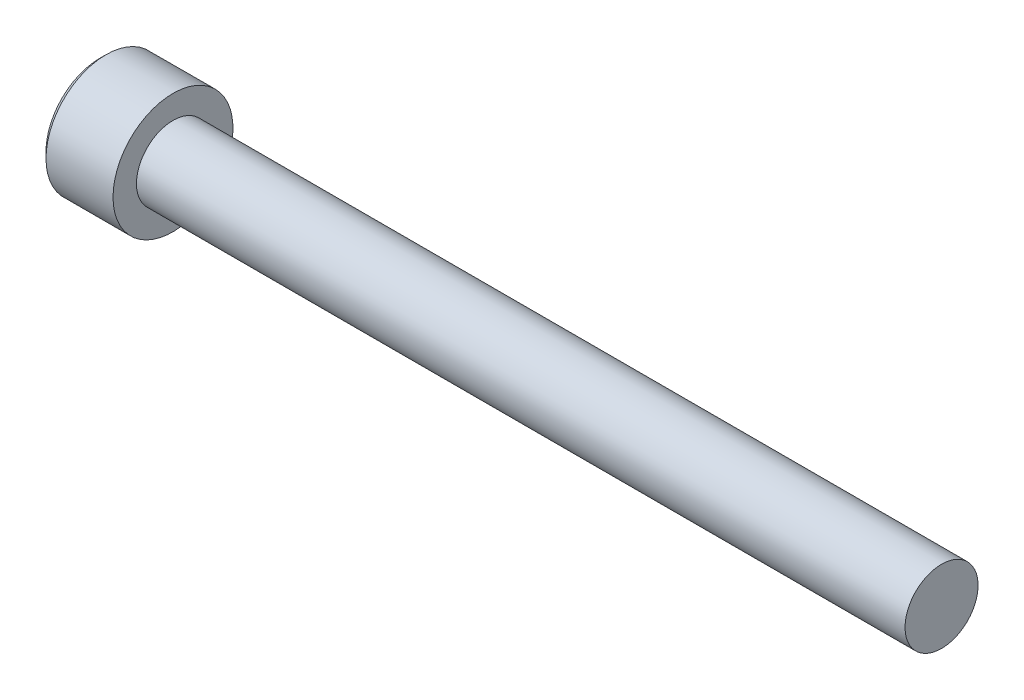
ISO-10303-21;
HEADER;
FILE_DESCRIPTION(('STEP AP214'),'2;1');
FILE_NAME('part.step','',(''),(''),'','','');
FILE_SCHEMA(('AUTOMOTIVE_DESIGN { 1 0 10303 214 1 1 1 1 }'));
ENDSEC;
DATA;
#1=APPLICATION_CONTEXT('core data for automotive mechanical design processes');
#2=APPLICATION_PROTOCOL_DEFINITION('international standard','automotive_design',2000,#1);
#3=PRODUCT_CONTEXT('',#1,'mechanical');
#4=PRODUCT('Part','Part','',(#3));
#5=PRODUCT_RELATED_PRODUCT_CATEGORY('part','',(#4));
#6=PRODUCT_DEFINITION_FORMATION('','',#4);
#7=PRODUCT_DEFINITION_CONTEXT('part definition',#1,'design');
#8=PRODUCT_DEFINITION('design','',#6,#7);
#9=PRODUCT_DEFINITION_SHAPE('','',#8);
#10=(LENGTH_UNIT() NAMED_UNIT(*) SI_UNIT(.MILLI.,.METRE.));
#11=(NAMED_UNIT(*) PLANE_ANGLE_UNIT() SI_UNIT($,.RADIAN.));
#12=(NAMED_UNIT(*) SI_UNIT($,.STERADIAN.) SOLID_ANGLE_UNIT());
#13=UNCERTAINTY_MEASURE_WITH_UNIT(LENGTH_MEASURE(1.E-05),#10,'distance_accuracy_value','');
#14=(GEOMETRIC_REPRESENTATION_CONTEXT(3) GLOBAL_UNCERTAINTY_ASSIGNED_CONTEXT((#13)) GLOBAL_UNIT_ASSIGNED_CONTEXT((#10,
#11,#12)) REPRESENTATION_CONTEXT('',''));
#15=CARTESIAN_POINT('',(0.,0.,0.));
#16=DIRECTION('',(0.,0.,1.));
#17=DIRECTION('',(1.,0.,0.));
#18=AXIS2_PLACEMENT_3D('',#15,#16,#17);
#19=CARTESIAN_POINT('',(-2.28600000000007,-1.14567944042317,1.984375));
#20=DIRECTION('',(0.,0.,1.));
#21=DIRECTION('',(1.,0.,0.));
#22=AXIS2_PLACEMENT_3D('',#19,#20,#21);
#23=PLANE('',#22);
#24=CARTESIAN_POINT('',(-4.82599999995852,1.14567944044653,1.98437499999554));
#25=CARTESIAN_POINT('',(-4.78691618362732,1.06743880343266,1.9843749999984));
#26=CARTESIAN_POINT('',(-4.75011447684892,0.987898318960917,1.98437499999957));
#27=CARTESIAN_POINT('',(-4.68265620500518,0.825677042028778,1.98437500000043));
#28=CARTESIAN_POINT('',(-4.65204056061138,0.742979382529199,1.98437500000012));
#29=CARTESIAN_POINT('',(-4.5991739228306,0.575193959555969,1.98437499999988));
#30=CARTESIAN_POINT('',(-4.57689462080725,0.490115359117279,1.98437499999997));
#31=CARTESIAN_POINT('',(-4.54259467221837,0.318093091130193,1.98437500000003));
#32=CARTESIAN_POINT('',(-4.5305423022885,0.231156054976726,1.984375));
#33=CARTESIAN_POINT('',(-4.52249110263747,0.119918521511051,1.984375));
#34=CARTESIAN_POINT('',(-4.52118947557477,0.0959468443046798,1.984375));
#35=CARTESIAN_POINT('',(-4.51945182629813,0.0479845644411998,1.984375));
#36=CARTESIAN_POINT('',(-4.51901533386223,0.0239939791589393,1.984375));
#37=CARTESIAN_POINT('',(-4.51901809008399,-0.0602201717457363,1.984375));
#38=CARTESIAN_POINT('',(-4.52177452299902,-0.120461721905447,1.984375));
#39=CARTESIAN_POINT('',(-4.5326365512493,-0.240474970989197,1.984375));
#40=CARTESIAN_POINT('',(-4.54074587749718,-0.300246312758427,1.984375));
#41=CARTESIAN_POINT('',(-4.57259622946939,-0.478763752804282,1.984375));
#42=CARTESIAN_POINT('',(-4.60385422611702,-0.596208828937734,1.984375));
#43=CARTESIAN_POINT('',(-4.66780003592237,-0.785921487441256,1.984375));
#44=CARTESIAN_POINT('',(-4.69623457768558,-0.859734609866899,1.984375));
#45=CARTESIAN_POINT('',(-4.75786140400812,-1.00456595519282,1.984375));
#46=CARTESIAN_POINT('',(-4.79100779300359,-1.07560356657101,1.984375));
#47=CARTESIAN_POINT('',(-4.82599999995643,-1.14567944044724,1.984375));
#48=B_SPLINE_CURVE_WITH_KNOTS('',3,(#24,#25,#26,#27,#28,#29,#30,#31,#32,#33,#34,#35,#36,#37,#38,
#39,#40,#41,#42,#43,#44,#45,#46,#47),.UNSPECIFIED.,.F.,.F.,(4,2,2,2,2,2,2,2,2,2,2,4),(0.,
0.262559005207405,0.526801735838036,0.790138824405318,1.05265603861765,1.12466619182083,
1.19663719499031,1.3772702672652,1.55802937209382,1.92104085090328,2.15819130092264,
2.39317265078575),.UNSPECIFIED.);
#49=CARTESIAN_POINT('',(-4.82599999996829,1.14567944041753,1.98437500003084));
#50=VERTEX_POINT('',#49);
#51=CARTESIAN_POINT('',(-4.8259999999622,-1.14567944043207,1.98437500001542));
#52=VERTEX_POINT('',#51);
#53=EDGE_CURVE('E21',#50,#52,#48,.T.);
#54=ORIENTED_EDGE('',*,*,#53,.F.);
#55=DIRECTION('',(1.,0.,0.));
#56=VECTOR('',#55,1.);
#57=CARTESIAN_POINT('',(-2.28600000000007,1.14567944042316,1.984375));
#58=LINE('',#57,#56);
#59=CARTESIAN_POINT('',(-2.28600000000007,1.14567944042316,1.984375));
#60=VERTEX_POINT('',#59);
#61=EDGE_CURVE('E70',#50,#60,#58,.T.);
#62=ORIENTED_EDGE('',*,*,#61,.T.);
#63=DIRECTION('',(0.,1.,0.));
#64=VECTOR('',#63,1.);
#65=CARTESIAN_POINT('',(-2.28600000000007,0.,1.984375));
#66=LINE('',#65,#64);
#67=CARTESIAN_POINT('',(-2.28600000000007,-1.14567944042317,1.984375));
#68=VERTEX_POINT('',#67);
#69=EDGE_CURVE('E76',#68,#60,#66,.T.);
#70=ORIENTED_EDGE('',*,*,#69,.F.);
#71=DIRECTION('',(1.,0.,0.));
#72=VECTOR('',#71,1.);
#73=CARTESIAN_POINT('',(-2.28600000000007,-1.14567944042317,1.984375));
#74=LINE('',#73,#72);
#75=EDGE_CURVE('E73',#68,#52,#74,.F.);
#76=ORIENTED_EDGE('',*,*,#75,.T.);
#77=EDGE_LOOP('',(#54,#62,#70,#76));
#78=FACE_BOUND('',#77,.T.);
#79=ADVANCED_FACE('F17',(#78),#23,.F.);
#80=CARTESIAN_POINT('',(-2.28600000000007,0.,0.));
#81=DIRECTION('',(-1.,0.,0.));
#82=DIRECTION('',(0.,0.,1.));
#83=AXIS2_PLACEMENT_3D('',#80,#81,#82);
#84=PLANE('',#83);
#85=DIRECTION('',(0.,0.5,0.866025403784439));
#86=VECTOR('',#85,1.);
#87=CARTESIAN_POINT('',(-2.28600000000007,2.29135888084633,0.));
#88=LINE('',#87,#86);
#89=CARTESIAN_POINT('',(-2.28600000000007,2.29135888084633,0.));
#90=VERTEX_POINT('',#89);
#91=CARTESIAN_POINT('',(-2.28600000000007,1.14567944042316,-1.984375));
#92=VERTEX_POINT('',#91);
#93=EDGE_CURVE('E84',#90,#92,#88,.F.);
#94=ORIENTED_EDGE('',*,*,#93,.T.);
#95=DIRECTION('',(0.,1.,0.));
#96=VECTOR('',#95,1.);
#97=CARTESIAN_POINT('',(-2.28600000000007,1.14567944042316,-1.984375));
#98=LINE('',#97,#96);
#99=CARTESIAN_POINT('',(-2.28600000000007,-1.14567944042316,-1.984375));
#100=VERTEX_POINT('',#99);
#101=EDGE_CURVE('E249',#92,#100,#98,.F.);
#102=ORIENTED_EDGE('',*,*,#101,.T.);
#103=DIRECTION('',(0.,0.5,-0.866025403784439));
#104=VECTOR('',#103,1.);
#105=CARTESIAN_POINT('',(-2.28600000000007,-1.14567944042316,-1.984375));
#106=LINE('',#105,#104);
#107=CARTESIAN_POINT('',(-2.28600000000007,-2.29135888084633,0.));
#108=VERTEX_POINT('',#107);
#109=EDGE_CURVE('E234',#100,#108,#106,.F.);
#110=ORIENTED_EDGE('',*,*,#109,.T.);
#111=DIRECTION('',(0.,-0.5,-0.866025403784439));
#112=VECTOR('',#111,1.);
#113=CARTESIAN_POINT('',(-2.28600000000007,-2.29135888084633,0.));
#114=LINE('',#113,#112);
#115=EDGE_CURVE('E231',#108,#68,#114,.F.);
#116=ORIENTED_EDGE('',*,*,#115,.T.);
#117=ORIENTED_EDGE('',*,*,#69,.T.);
#118=DIRECTION('',(0.,-0.5,0.866025403784439));
#119=VECTOR('',#118,1.);
#120=CARTESIAN_POINT('',(-2.28600000000007,1.14567944042316,1.984375));
#121=LINE('',#120,#119);
#122=EDGE_CURVE('E83',#60,#90,#121,.F.);
#123=ORIENTED_EDGE('',*,*,#122,.T.);
#124=EDGE_LOOP('',(#94,#102,#110,#116,#117,#123));
#125=FACE_BOUND('',#124,.T.);
#126=ADVANCED_FACE('F166',(#125),#84,.T.);
#127=CARTESIAN_POINT('',(-2.28600000000007,-1.14567944042316,-1.984375));
#128=DIRECTION('',(0.,-0.866025403784439,-0.5));
#129=DIRECTION('',(0.,0.5,-0.866025403784439));
#130=AXIS2_PLACEMENT_3D('',#127,#128,#129);
#131=PLANE('',#130);
#132=CARTESIAN_POINT('',(-4.82599999995871,-1.14567944040756,-1.98437500001887));
#133=CARTESIAN_POINT('',(-4.78666022792997,-1.18505700230148,-1.91617106214563));
#134=CARTESIAN_POINT('',(-4.74963132844072,-1.22509295783734,-1.8468267530301));
#135=CARTESIAN_POINT('',(-4.68183299424977,-1.30673037975396,-1.70542659047317));
#136=CARTESIAN_POINT('',(-4.65110127019237,-1.34833960561553,-1.63335729721673));
#137=CARTESIAN_POINT('',(-4.59845762010516,-1.432242568594,-1.48803310243203));
#138=CARTESIAN_POINT('',(-4.57641341195893,-1.47451494967301,-1.41481519064643));
#139=CARTESIAN_POINT('',(-4.5424501106744,-1.55999007976842,-1.26676792253773));
#140=CARTESIAN_POINT('',(-4.53050567471972,-1.6031902195197,-1.19194308559438));
#141=CARTESIAN_POINT('',(-4.51972842752365,-1.67764765054852,-1.06297903205139));
#142=CARTESIAN_POINT('',(-4.51813352794835,-1.70880881707173,-1.00900630841009));
#143=CARTESIAN_POINT('',(-4.52082392138599,-1.77108016542046,-0.901149169214274));
#144=CARTESIAN_POINT('',(-4.52511127545884,-1.80219032554946,-0.847264791239237));
#145=CARTESIAN_POINT('',(-4.53932219421538,-1.86411684097343,-0.740004920189235));
#146=CARTESIAN_POINT('',(-4.54925206045723,-1.8949328285454,-0.686630064029166));
#147=CARTESIAN_POINT('',(-4.5742029484467,-1.95603190279815,-0.580803363127977));
#148=CARTESIAN_POINT('',(-4.58922357974385,-1.98631503016081,-0.528351447923769));
#149=CARTESIAN_POINT('',(-4.63380478900425,-2.06386502548479,-0.394030915895904));
#150=CARTESIAN_POINT('',(-4.66672213384104,-2.11065153226583,-0.312994309042483));
#151=CARTESIAN_POINT('',(-4.72228952038986,-2.17944749410732,-0.193836207777459));
#152=CARTESIAN_POINT('',(-4.74181309375939,-2.20211890802843,-0.154568166986659));
#153=CARTESIAN_POINT('',(-4.78263970065987,-2.24704195201531,-0.076759172370747));
#154=CARTESIAN_POINT('',(-4.80394164363173,-2.2692938292399,-0.038217790453971));
#155=CARTESIAN_POINT('',(-4.82599999995675,-2.29135888085868,2.13931096249392E-11));
#156=B_SPLINE_CURVE_WITH_KNOTS('',3,(#132,#133,#134,#135,#136,#137,#138,#139,#140,#141,#142,
#143,#144,#145,#146,#147,#148,#149,#150,#151,#152,#153,#154,#155),.UNSPECIFIED.,.F.,.F.,(4,2,2,
2,2,2,2,2,2,2,2,4),(0.,0.264284909626495,0.530108996358093,0.791712695414127,1.05265800174404,
1.23942150116703,1.42625045663858,1.61328847394198,1.80031214908683,2.09727151182814,
2.24534838946042,2.39333511890876),.UNSPECIFIED.);
#157=CARTESIAN_POINT('',(-4.8259999999622,-1.14567944043207,-1.98437500001542));
#158=VERTEX_POINT('',#157);
#159=CARTESIAN_POINT('',(-4.82599999996846,-2.2913588808704,-2.0004354349219E-11));
#160=VERTEX_POINT('',#159);
#161=EDGE_CURVE('E168',#158,#160,#156,.T.);
#162=ORIENTED_EDGE('',*,*,#161,.T.);
#163=DIRECTION('',(1.,0.,0.));
#164=VECTOR('',#163,1.);
#165=CARTESIAN_POINT('',(-2.28600000000007,-2.29135888084633,0.));
#166=LINE('',#165,#164);
#167=EDGE_CURVE('E242',#160,#108,#166,.T.);
#168=ORIENTED_EDGE('',*,*,#167,.T.);
#169=ORIENTED_EDGE('',*,*,#109,.F.);
#170=DIRECTION('',(-1.,0.,0.));
#171=VECTOR('',#170,1.);
#172=CARTESIAN_POINT('',(-2.28600000000007,-1.14567944042316,-1.984375));
#173=LINE('',#172,#171);
#174=EDGE_CURVE('E252',#100,#158,#173,.T.);
#175=ORIENTED_EDGE('',*,*,#174,.T.);
#176=EDGE_LOOP('',(#162,#168,#169,#175));
#177=FACE_BOUND('',#176,.T.);
#178=ADVANCED_FACE('F162',(#177),#131,.F.);
#179=CARTESIAN_POINT('',(-2.28600000000007,-2.29135888084633,0.));
#180=DIRECTION('',(0.,-0.866025403784439,0.5));
#181=DIRECTION('',(0.,-0.5,-0.866025403784439));
#182=AXIS2_PLACEMENT_3D('',#179,#180,#181);
#183=PLANE('',#182);
#184=CARTESIAN_POINT('',(-4.8259999999587,-2.29135888085486,-2.29477011545215E-11));
#185=CARTESIAN_POINT('',(-4.78666022792997,-2.25198131896546,0.0682039378529047));
#186=CARTESIAN_POINT('',(-4.74963132844072,-2.21194536343147,0.137548246969502));
#187=CARTESIAN_POINT('',(-4.68183299424977,-2.13030794151622,0.278948409527228));
#188=CARTESIAN_POINT('',(-4.65110127019237,-2.08869871565414,0.351017702783377));
#189=CARTESIAN_POINT('',(-4.59845762010516,-2.00479575267531,0.496341897567867));
#190=CARTESIAN_POINT('',(-4.57641341195893,-1.96252337159644,0.569559809353539));
#191=CARTESIAN_POINT('',(-4.5424501106744,-1.87704824150112,0.717607077462299));
#192=CARTESIAN_POINT('',(-4.53050567471972,-1.8338481017498,0.792431914405622));
#193=CARTESIAN_POINT('',(-4.51972842752365,-1.75939067072096,0.921395967948603));
#194=CARTESIAN_POINT('',(-4.51813352794834,-1.72822950419776,0.975368691589913));
#195=CARTESIAN_POINT('',(-4.52082392138599,-1.66595815584903,1.08322583078573));
#196=CARTESIAN_POINT('',(-4.52511127545884,-1.63484799572003,1.13711020876076));
#197=CARTESIAN_POINT('',(-4.53932219421538,-1.57292148029607,1.24437007981077));
#198=CARTESIAN_POINT('',(-4.54925206045723,-1.54210549272409,1.29774493597084));
#199=CARTESIAN_POINT('',(-4.5742029484467,-1.48100641847134,1.40357163687202));
#200=CARTESIAN_POINT('',(-4.58922357974385,-1.45072329110868,1.45602355207623));
#201=CARTESIAN_POINT('',(-4.63380478900421,-1.37317329578476,1.59034408410398));
#202=CARTESIAN_POINT('',(-4.66672213384095,-1.32638678900379,1.6713806909573));
#203=CARTESIAN_POINT('',(-4.72228952038968,-1.25759082716239,1.79053879222216));
#204=CARTESIAN_POINT('',(-4.74181309375917,-1.23491941324131,1.82980683301291));
#205=CARTESIAN_POINT('',(-4.78263970065959,-1.18999636925449,1.90761582762872));
#206=CARTESIAN_POINT('',(-4.8039416436314,-1.16774449202993,1.94615720954545));
#207=CARTESIAN_POINT('',(-4.82599999995639,-1.14567944041117,1.98437500002077));
#208=B_SPLINE_CURVE_WITH_KNOTS('',3,(#184,#185,#186,#187,#188,#189,#190,#191,#192,#193,#194,
#195,#196,#197,#198,#199,#200,#201,#202,#203,#204,#205,#206,#207),.UNSPECIFIED.,.F.,.F.,(4,2,2,
2,2,2,2,2,2,2,2,4),(0.,0.264284909626493,0.530108996358089,0.791712695414125,1.05265800174404,
1.23942150116703,1.42625045663858,1.61328847394198,1.80031214908683,2.09727151182773,
2.24534838945981,2.39333511890795),.UNSPECIFIED.);
#209=EDGE_CURVE('E93',#160,#52,#208,.T.);
#210=ORIENTED_EDGE('',*,*,#209,.T.);
#211=ORIENTED_EDGE('',*,*,#75,.F.);
#212=ORIENTED_EDGE('',*,*,#115,.F.);
#213=ORIENTED_EDGE('',*,*,#167,.F.);
#214=EDGE_LOOP('',(#210,#211,#212,#213));
#215=FACE_BOUND('',#214,.T.);
#216=ADVANCED_FACE('F157',(#215),#183,.F.);
#217=CARTESIAN_POINT('',(-2.28600000000007,1.14567944042316,1.984375));
#218=DIRECTION('',(0.,0.866025403784439,0.5));
#219=DIRECTION('',(0.,-0.5,0.866025403784439));
#220=AXIS2_PLACEMENT_3D('',#217,#218,#219);
#221=PLANE('',#220);
#222=CARTESIAN_POINT('',(-4.82599999995852,1.14567944040762,1.98437500001801));
#223=CARTESIAN_POINT('',(-4.78666022792973,1.1850570023017,1.91617106214498));
#224=CARTESIAN_POINT('',(-4.74963132844047,1.22509295783761,1.84682675302957));
#225=CARTESIAN_POINT('',(-4.68183299424957,1.30673037975422,1.70542659047278));
#226=CARTESIAN_POINT('',(-4.65110127019222,1.34833960561574,1.63335729721638));
#227=CARTESIAN_POINT('',(-4.59845762010509,1.43224256859413,1.48803310243178));
#228=CARTESIAN_POINT('',(-4.57641341195888,1.47451494967311,1.41481519064625));
#229=CARTESIAN_POINT('',(-4.54245011067439,1.55999007976846,1.26676792253767));
#230=CARTESIAN_POINT('',(-4.53050567471972,1.6031902195197,1.19194308559439));
#231=CARTESIAN_POINT('',(-4.51972842752365,1.67764765054848,1.06297903205146));
#232=CARTESIAN_POINT('',(-4.51813352794835,1.70880881707169,1.00900630841016));
#233=CARTESIAN_POINT('',(-4.52082392138598,1.77108016542041,0.901149169214364));
#234=CARTESIAN_POINT('',(-4.52511127545883,1.80219032554941,0.847264791239333));
#235=CARTESIAN_POINT('',(-4.53932219421536,1.86411684097336,0.740004920189342));
#236=CARTESIAN_POINT('',(-4.54925206045721,1.89493282854533,0.686630064029279));
#237=CARTESIAN_POINT('',(-4.57420294844667,1.95603190279808,0.580803363128101));
#238=CARTESIAN_POINT('',(-4.58922357974382,1.98631503016074,0.528351447923897));
#239=CARTESIAN_POINT('',(-4.6338047890042,2.06386502548473,0.394030915896012));
#240=CARTESIAN_POINT('',(-4.666722133841,2.11065153226578,0.312994309042568));
#241=CARTESIAN_POINT('',(-4.72228952038984,2.17944749410729,0.19383620777751));
#242=CARTESIAN_POINT('',(-4.74181309375937,2.20211890802841,0.1545681669867));
#243=CARTESIAN_POINT('',(-4.78263970065986,2.24704195201529,0.0767591723707675));
#244=CARTESIAN_POINT('',(-4.80394164363172,2.26929382923989,0.0382177904539812));
#245=CARTESIAN_POINT('',(-4.82599999995675,2.29135888085868,-2.13928869462937E-11));
#246=B_SPLINE_CURVE_WITH_KNOTS('',3,(#222,#223,#224,#225,#226,#227,#228,#229,#230,#231,#232,
#233,#234,#235,#236,#237,#238,#239,#240,#241,#242,#243,#244,#245),.UNSPECIFIED.,.F.,.F.,(4,2,2,
2,2,2,2,2,2,2,2,4),(0.,0.26428490962629,0.530108996357672,0.791712695413487,1.05265800174319,
1.23942150116616,1.42625045663768,1.61328847394106,1.80031214908589,2.09727151182728,
2.2453483894596,2.39333511890798),.UNSPECIFIED.);
#247=CARTESIAN_POINT('',(-4.82599999996846,2.29135888087039,2.00042061036289E-11));
#248=VERTEX_POINT('',#247);
#249=EDGE_CURVE('E81',#50,#248,#246,.T.);
#250=ORIENTED_EDGE('',*,*,#249,.T.);
#251=DIRECTION('',(1.,0.,0.));
#252=VECTOR('',#251,1.);
#253=CARTESIAN_POINT('',(-2.28600000000007,2.29135888084633,0.));
#254=LINE('',#253,#252);
#255=EDGE_CURVE('E253',#248,#90,#254,.T.);
#256=ORIENTED_EDGE('',*,*,#255,.T.);
#257=ORIENTED_EDGE('',*,*,#122,.F.);
#258=ORIENTED_EDGE('',*,*,#61,.F.);
#259=EDGE_LOOP('',(#250,#256,#257,#258));
#260=FACE_BOUND('',#259,.T.);
#261=ADVANCED_FACE('F78',(#260),#221,.F.);
#262=CARTESIAN_POINT('',(-2.28600000000007,2.29135888084633,0.));
#263=DIRECTION('',(0.,0.866025403784439,-0.5));
#264=DIRECTION('',(0.,0.5,0.866025403784439));
#265=AXIS2_PLACEMENT_3D('',#262,#263,#264);
#266=PLANE('',#265);
#267=CARTESIAN_POINT('',(-4.82599999995871,2.29135888085486,2.29489280696873E-11));
#268=CARTESIAN_POINT('',(-4.78666022792997,2.25198131896546,-0.0682039378529041));
#269=CARTESIAN_POINT('',(-4.74963132844072,2.21194536343147,-0.137548246969502));
#270=CARTESIAN_POINT('',(-4.68183299424977,2.13030794151622,-0.278948409527229));
#271=CARTESIAN_POINT('',(-4.65110127019237,2.08869871565414,-0.351017702783379));
#272=CARTESIAN_POINT('',(-4.59845762010516,2.00479575267531,-0.496341897567869));
#273=CARTESIAN_POINT('',(-4.57641341195893,1.96252337159644,-0.569559809353541));
#274=CARTESIAN_POINT('',(-4.5424501106744,1.87704824150112,-0.7176070774623));
#275=CARTESIAN_POINT('',(-4.53050567471972,1.8338481017498,-0.792431914405622));
#276=CARTESIAN_POINT('',(-4.51972842752365,1.75939067072096,-0.921395967948602));
#277=CARTESIAN_POINT('',(-4.51813352794835,1.72822950419776,-0.975368691589912));
#278=CARTESIAN_POINT('',(-4.52082392138599,1.66595815584903,-1.08322583078573));
#279=CARTESIAN_POINT('',(-4.52511127545884,1.63484799572003,-1.13711020876076));
#280=CARTESIAN_POINT('',(-4.53932219421538,1.57292148029607,-1.24437007981077));
#281=CARTESIAN_POINT('',(-4.54925206045723,1.54210549272409,-1.29774493597083));
#282=CARTESIAN_POINT('',(-4.5742029484467,1.48100641847134,-1.40357163687202));
#283=CARTESIAN_POINT('',(-4.58922357974385,1.45072329110868,-1.45602355207623));
#284=CARTESIAN_POINT('',(-4.63380478900425,1.3731732957847,-1.5903440841041));
#285=CARTESIAN_POINT('',(-4.66672213384104,1.32638678900366,-1.67138069095752));
#286=CARTESIAN_POINT('',(-4.72228952038986,1.25759082716218,-1.79053879222254));
#287=CARTESIAN_POINT('',(-4.74181309375939,1.23491941324106,-1.82980683301334));
#288=CARTESIAN_POINT('',(-4.78263970065987,1.18999636925419,-1.90761582762925));
#289=CARTESIAN_POINT('',(-4.80394164363173,1.1677444920296,-1.94615720954603));
#290=CARTESIAN_POINT('',(-4.82599999995675,1.14567944041081,-1.98437500002139));
#291=B_SPLINE_CURVE_WITH_KNOTS('',3,(#267,#268,#269,#270,#271,#272,#273,#274,#275,#276,#277,
#278,#279,#280,#281,#282,#283,#284,#285,#286,#287,#288,#289,#290),.UNSPECIFIED.,.F.,.F.,(4,2,2,
2,2,2,2,2,2,2,2,4),(0.,0.264284909626495,0.530108996358094,0.791712695414128,1.05265800174404,
1.23942150116703,1.42625045663858,1.61328847394198,1.80031214908683,2.09727151182814,
2.24534838946042,2.39333511890876),.UNSPECIFIED.);
#292=CARTESIAN_POINT('',(-4.82599999996846,1.14567944045252,-1.98437500001084));
#293=VERTEX_POINT('',#292);
#294=EDGE_CURVE('E41',#248,#293,#291,.T.);
#295=ORIENTED_EDGE('',*,*,#294,.T.);
#296=DIRECTION('',(-1.,0.,0.));
#297=VECTOR('',#296,1.);
#298=CARTESIAN_POINT('',(-2.28600000000007,1.14567944042316,-1.984375));
#299=LINE('',#298,#297);
#300=EDGE_CURVE('E173',#293,#92,#299,.F.);
#301=ORIENTED_EDGE('',*,*,#300,.T.);
#302=ORIENTED_EDGE('',*,*,#93,.F.);
#303=ORIENTED_EDGE('',*,*,#255,.F.);
#304=EDGE_LOOP('',(#295,#301,#302,#303));
#305=FACE_BOUND('',#304,.T.);
#306=ADVANCED_FACE('F156',(#305),#266,.F.);
#307=CARTESIAN_POINT('',(-2.28600000000007,1.14567944042316,-1.984375));
#308=DIRECTION('',(0.,0.,-1.));
#309=DIRECTION('',(-1.,0.,0.));
#310=AXIS2_PLACEMENT_3D('',#307,#308,#309);
#311=PLANE('',#310);
#312=CARTESIAN_POINT('',(-4.8259999999587,1.14567944044731,-1.98437499999592));
#313=CARTESIAN_POINT('',(-4.78666022793094,1.06692431665146,-1.98437499999853));
#314=CARTESIAN_POINT('',(-4.74963132844318,0.986852405569011,-1.98437499999961));
#315=CARTESIAN_POINT('',(-4.6818329942566,0.823577561711963,-1.9843750000004));
#316=CARTESIAN_POINT('',(-4.65110127020207,0.740359109975722,-1.98437500000011));
#317=CARTESIAN_POINT('',(-4.59845762012233,0.572553183993917,-1.9843749999999));
#318=CARTESIAN_POINT('',(-4.57641341198063,0.488008421824127,-1.98437499999997));
#319=CARTESIAN_POINT('',(-4.54245011070673,0.317058161610178,-1.98437500000003));
#320=CARTESIAN_POINT('',(-4.53050567475816,0.230657882096267,-1.98437500000001));
#321=CARTESIAN_POINT('',(-4.51972842757294,0.0817430200124032,-1.984375));
#322=CARTESIAN_POINT('',(-4.51813352800283,0.0194206869508218,-1.984375));
#323=CARTESIAN_POINT('',(-4.52082392145254,-0.1051220097764,-1.984375));
#324=CARTESIAN_POINT('',(-4.52511127553227,-0.167342330049008,-1.984375));
#325=CARTESIAN_POINT('',(-4.53932219430377,-0.291195360925477,-1.984375));
#326=CARTESIAN_POINT('',(-4.54925206055372,-0.352827336083362,-1.984375));
#327=CARTESIAN_POINT('',(-4.57420294856008,-0.475025484616114,-1.984375));
#328=CARTESIAN_POINT('',(-4.58922357986604,-0.535591739354747,-1.984375));
#329=CARTESIAN_POINT('',(-4.63380478912724,-0.690691729958653,-1.984375));
#330=CARTESIAN_POINT('',(-4.66672213394715,-0.784264743465576,-1.984375));
#331=CARTESIAN_POINT('',(-4.7222895204619,-0.921856667069616,-1.984375));
#332=CARTESIAN_POINT('',(-4.74181309381856,-0.967199494886089,-1.984375));
#333=CARTESIAN_POINT('',(-4.78263970069104,-1.05704558280959,-1.984375));
#334=CARTESIAN_POINT('',(-4.80394164364776,-1.10154933723428,-1.984375));
#335=CARTESIAN_POINT('',(-4.82599999995675,-1.14567944044787,-1.984375));
#336=B_SPLINE_CURVE_WITH_KNOTS('',3,(#312,#313,#314,#315,#316,#317,#318,#319,#320,#321,#322,
#323,#324,#325,#326,#327,#328,#329,#330,#331,#332,#333,#334,#335),.UNSPECIFIED.,.F.,.F.,(4,2,2,
2,2,2,2,2,2,2,2,4),(0.,0.264284909658836,0.530108996422784,0.791712695509868,1.0526580018708,
1.23942150133878,1.42625045685537,1.61328847420389,1.80031214939384,2.09727151196384,
2.24534838950992,2.39333511887245),.UNSPECIFIED.);
#337=EDGE_CURVE('E110',#293,#158,#336,.T.);
#338=ORIENTED_EDGE('',*,*,#337,.T.);
#339=ORIENTED_EDGE('',*,*,#174,.F.);
#340=ORIENTED_EDGE('',*,*,#101,.F.);
#341=ORIENTED_EDGE('',*,*,#300,.F.);
#342=EDGE_LOOP('',(#338,#339,#340,#341));
#343=FACE_BOUND('',#342,.T.);
#344=ADVANCED_FACE('F125',(#343),#311,.F.);
#345=CARTESIAN_POINT('',(-4.82599999998001,0.,0.));
#346=DIRECTION('',(-1.,0.,0.));
#347=DIRECTION('',(0.,0.,1.));
#348=AXIS2_PLACEMENT_3D('',#345,#346,#347);
#349=CONICAL_SURFACE('',#348,2.29135888088194,0.785398163397448);
#350=ORIENTED_EDGE('',*,*,#161,.F.);
#351=CARTESIAN_POINT('',(-4.82599999998001,0.,0.));
#352=DIRECTION('',(-1.,0.,0.));
#353=DIRECTION('',(0.,0.,1.));
#354=AXIS2_PLACEMENT_3D('',#351,#352,#353);
#355=CIRCLE('',#354,2.29135888088194);
#356=EDGE_CURVE('E107',#158,#160,#355,.T.);
#357=ORIENTED_EDGE('',*,*,#356,.T.);
#358=EDGE_LOOP('',(#350,#357));
#359=FACE_BOUND('',#358,.T.);
#360=ADVANCED_FACE('F174',(#359),#349,.F.);
#361=CARTESIAN_POINT('',(-4.82599999998001,0.,0.));
#362=DIRECTION('',(-1.,0.,0.));
#363=DIRECTION('',(0.,0.,1.));
#364=AXIS2_PLACEMENT_3D('',#361,#362,#363);
#365=CONICAL_SURFACE('',#364,2.29135888088194,0.785398163397448);
#366=ORIENTED_EDGE('',*,*,#209,.F.);
#367=CARTESIAN_POINT('',(-4.82599999998001,0.,0.));
#368=DIRECTION('',(-1.,0.,0.));
#369=DIRECTION('',(0.,0.,1.));
#370=AXIS2_PLACEMENT_3D('',#367,#368,#369);
#371=CIRCLE('',#370,2.29135888088194);
#372=EDGE_CURVE('E88',#160,#52,#371,.T.);
#373=ORIENTED_EDGE('',*,*,#372,.T.);
#374=EDGE_LOOP('',(#366,#373));
#375=FACE_BOUND('',#374,.T.);
#376=ADVANCED_FACE('F177',(#375),#365,.F.);
#377=CARTESIAN_POINT('',(-4.82599999998001,0.,0.));
#378=DIRECTION('',(-1.,0.,0.));
#379=DIRECTION('',(0.,0.,1.));
#380=AXIS2_PLACEMENT_3D('',#377,#378,#379);
#381=CONICAL_SURFACE('',#380,2.29135888088194,0.78539816348948);
#382=CARTESIAN_POINT('',(-4.82599999998001,0.,0.));
#383=DIRECTION('',(-1.,0.,0.));
#384=DIRECTION('',(0.,0.,1.));
#385=AXIS2_PLACEMENT_3D('',#382,#383,#384);
#386=CIRCLE('',#385,2.29135888088194);
#387=EDGE_CURVE('E61',#52,#50,#386,.T.);
#388=ORIENTED_EDGE('',*,*,#387,.T.);
#389=ORIENTED_EDGE('',*,*,#53,.T.);
#390=EDGE_LOOP('',(#388,#389));
#391=FACE_BOUND('',#390,.T.);
#392=ADVANCED_FACE('F86',(#391),#381,.F.);
#393=CARTESIAN_POINT('',(-4.82599999998001,0.,0.));
#394=DIRECTION('',(-1.,0.,0.));
#395=DIRECTION('',(0.,0.,1.));
#396=AXIS2_PLACEMENT_3D('',#393,#394,#395);
#397=CONICAL_SURFACE('',#396,2.29135888088194,0.785398163397448);
#398=ORIENTED_EDGE('',*,*,#249,.F.);
#399=CARTESIAN_POINT('',(-4.82599999998001,0.,0.));
#400=DIRECTION('',(-1.,0.,0.));
#401=DIRECTION('',(0.,0.,1.));
#402=AXIS2_PLACEMENT_3D('',#399,#400,#401);
#403=CIRCLE('',#402,2.29135888088194);
#404=EDGE_CURVE('E87',#50,#248,#403,.T.);
#405=ORIENTED_EDGE('',*,*,#404,.T.);
#406=EDGE_LOOP('',(#398,#405));
#407=FACE_BOUND('',#406,.T.);
#408=ADVANCED_FACE('F92',(#407),#397,.F.);
#409=CARTESIAN_POINT('',(-4.82599999998001,0.,0.));
#410=DIRECTION('',(-1.,0.,0.));
#411=DIRECTION('',(0.,0.,1.));
#412=AXIS2_PLACEMENT_3D('',#409,#410,#411);
#413=CONICAL_SURFACE('',#412,2.29135888088194,0.785398163397448);
#414=ORIENTED_EDGE('',*,*,#294,.F.);
#415=CARTESIAN_POINT('',(-4.82599999998001,0.,0.));
#416=DIRECTION('',(-1.,0.,0.));
#417=DIRECTION('',(0.,0.,1.));
#418=AXIS2_PLACEMENT_3D('',#415,#416,#417);
#419=CIRCLE('',#418,2.29135888088194);
#420=EDGE_CURVE('E99',#248,#293,#419,.T.);
#421=ORIENTED_EDGE('',*,*,#420,.T.);
#422=EDGE_LOOP('',(#414,#421));
#423=FACE_BOUND('',#422,.T.);
#424=ADVANCED_FACE('F132',(#423),#413,.F.);
#425=CARTESIAN_POINT('',(-4.82599999998001,0.,0.));
#426=DIRECTION('',(-1.,0.,0.));
#427=DIRECTION('',(0.,0.,1.));
#428=AXIS2_PLACEMENT_3D('',#425,#426,#427);
#429=CONICAL_SURFACE('',#428,2.29135888088194,0.785398163489476);
#430=ORIENTED_EDGE('',*,*,#337,.F.);
#431=CARTESIAN_POINT('',(-4.82599999998001,0.,0.));
#432=DIRECTION('',(-1.,0.,0.));
#433=DIRECTION('',(0.,0.,1.));
#434=AXIS2_PLACEMENT_3D('',#431,#432,#433);
#435=CIRCLE('',#434,2.29135888088194);
#436=EDGE_CURVE('E101',#293,#158,#435,.T.);
#437=ORIENTED_EDGE('',*,*,#436,.T.);
#438=EDGE_LOOP('',(#430,#437));
#439=FACE_BOUND('',#438,.T.);
#440=ADVANCED_FACE('F128',(#439),#429,.F.);
#441=CARTESIAN_POINT('',(-4.82600000000007,0.,0.));
#442=DIRECTION('',(1.,0.,0.));
#443=DIRECTION('',(0.,0.,-1.));
#444=AXIS2_PLACEMENT_3D('',#441,#442,#443);
#445=PLANE('',#444);
#446=CARTESIAN_POINT('',(-4.82599999998001,0.,0.));
#447=DIRECTION('',(1.,0.,0.));
#448=DIRECTION('',(0.,0.,-1.));
#449=AXIS2_PLACEMENT_3D('',#446,#447,#448);
#450=CIRCLE('',#449,3.56615999999121);
#451=CARTESIAN_POINT('',(-4.82599999998001,0.,-3.56615999999121));
#452=VERTEX_POINT('',#451);
#453=EDGE_CURVE('E219',#452,#452,#450,.T.);
#454=ORIENTED_EDGE('',*,*,#453,.F.);
#455=EDGE_LOOP('',(#454));
#456=FACE_BOUND('',#455,.T.);
#457=ORIENTED_EDGE('',*,*,#420,.F.);
#458=ORIENTED_EDGE('',*,*,#404,.F.);
#459=ORIENTED_EDGE('',*,*,#387,.F.);
#460=ORIENTED_EDGE('',*,*,#372,.F.);
#461=ORIENTED_EDGE('',*,*,#356,.F.);
#462=ORIENTED_EDGE('',*,*,#436,.F.);
#463=EDGE_LOOP('',(#457,#458,#459,#460,#461,#462));
#464=FACE_BOUND('',#463,.T.);
#465=ADVANCED_FACE('F96',(#456,#464),#445,.F.);
#466=CARTESIAN_POINT('',(-4.42976000010731,0.,0.));
#467=DIRECTION('',(1.,0.,0.));
#468=DIRECTION('',(0.,0.,-1.));
#469=AXIS2_PLACEMENT_3D('',#466,#467,#468);
#470=CONICAL_SURFACE('',#469,3.96239999986392,0.785398163397448);
#471=CARTESIAN_POINT('',(-4.42976000000007,0.,0.));
#472=DIRECTION('',(-1.,0.,0.));
#473=DIRECTION('',(0.,0.,1.));
#474=AXIS2_PLACEMENT_3D('',#471,#472,#473);
#475=CIRCLE('',#474,3.9624);
#476=CARTESIAN_POINT('',(-4.42976000000007,0.,3.9624));
#477=VERTEX_POINT('',#476);
#478=EDGE_CURVE('E216',#477,#477,#475,.F.);
#479=ORIENTED_EDGE('',*,*,#478,.F.);
#480=EDGE_LOOP('',(#479));
#481=FACE_BOUND('',#480,.T.);
#482=ORIENTED_EDGE('',*,*,#453,.T.);
#483=EDGE_LOOP('',(#482));
#484=FACE_BOUND('',#483,.T.);
#485=ADVANCED_FACE('F205',(#481,#484),#470,.T.);
#486=CARTESIAN_POINT('',(-4.82600000000008,0.,0.));
#487=DIRECTION('',(-1.,0.,0.));
#488=DIRECTION('',(0.,0.,1.));
#489=AXIS2_PLACEMENT_3D('',#486,#487,#488);
#490=CYLINDRICAL_SURFACE('',#489,3.9624);
#491=ORIENTED_EDGE('',*,*,#478,.T.);
#492=EDGE_LOOP('',(#491));
#493=FACE_BOUND('',#492,.T.);
#494=CARTESIAN_POINT('',(0.,0.,0.));
#495=DIRECTION('',(-1.,0.,0.));
#496=DIRECTION('',(0.,0.,1.));
#497=AXIS2_PLACEMENT_3D('',#494,#495,#496);
#498=CIRCLE('',#497,3.9624);
#499=CARTESIAN_POINT('',(0.,0.,3.9624));
#500=VERTEX_POINT('',#499);
#501=EDGE_CURVE('E221',#500,#500,#498,.T.);
#502=ORIENTED_EDGE('',*,*,#501,.T.);
#503=EDGE_LOOP('',(#502));
#504=FACE_BOUND('',#503,.T.);
#505=ADVANCED_FACE('F202',(#493,#504),#490,.T.);
#506=CARTESIAN_POINT('',(50.8,0.,0.));
#507=DIRECTION('',(1.,0.,0.));
#508=DIRECTION('',(0.,0.,-1.));
#509=AXIS2_PLACEMENT_3D('',#506,#507,#508);
#510=PLANE('',#509);
#511=CARTESIAN_POINT('',(50.8,0.,0.));
#512=DIRECTION('',(-1.,0.,0.));
#513=DIRECTION('',(0.,0.,1.));
#514=AXIS2_PLACEMENT_3D('',#511,#512,#513);
#515=CIRCLE('',#514,2.413);
#516=CARTESIAN_POINT('',(50.8,0.,2.413));
#517=VERTEX_POINT('',#516);
#518=EDGE_CURVE('E32',#517,#517,#515,.T.);
#519=ORIENTED_EDGE('',*,*,#518,.F.);
#520=EDGE_LOOP('',(#519));
#521=FACE_BOUND('',#520,.T.);
#522=ADVANCED_FACE('F195',(#521),#510,.T.);
#523=CARTESIAN_POINT('',(0.,3.9624,0.));
#524=DIRECTION('',(-1.,0.,0.));
#525=DIRECTION('',(0.,0.,1.));
#526=AXIS2_PLACEMENT_3D('',#523,#524,#525);
#527=PLANE('',#526);
#528=CARTESIAN_POINT('',(0.,0.,0.));
#529=DIRECTION('',(-1.,0.,0.));
#530=DIRECTION('',(0.,0.,1.));
#531=AXIS2_PLACEMENT_3D('',#528,#529,#530);
#532=CIRCLE('',#531,2.413);
#533=CARTESIAN_POINT('',(0.,0.,2.413));
#534=VERTEX_POINT('',#533);
#535=EDGE_CURVE('E11',#534,#534,#532,.F.);
#536=ORIENTED_EDGE('',*,*,#535,.F.);
#537=EDGE_LOOP('',(#536));
#538=FACE_BOUND('',#537,.T.);
#539=ORIENTED_EDGE('',*,*,#501,.F.);
#540=EDGE_LOOP('',(#539));
#541=FACE_BOUND('',#540,.T.);
#542=ADVANCED_FACE('F189',(#538,#541),#527,.F.);
#543=CARTESIAN_POINT('',(50.8,0.,0.));
#544=DIRECTION('',(-1.,0.,0.));
#545=DIRECTION('',(0.,0.,1.));
#546=AXIS2_PLACEMENT_3D('',#543,#544,#545);
#547=CYLINDRICAL_SURFACE('',#546,2.413);
#548=ORIENTED_EDGE('',*,*,#535,.T.);
#549=EDGE_LOOP('',(#548));
#550=FACE_BOUND('',#549,.T.);
#551=ORIENTED_EDGE('',*,*,#518,.T.);
#552=EDGE_LOOP('',(#551));
#553=FACE_BOUND('',#552,.T.);
#554=ADVANCED_FACE('F187',(#550,#553),#547,.T.);
#555=CLOSED_SHELL('',(#79,#126,#178,#216,#261,#306,#344,#360,#376,#392,#408,#424,#440,#465,#485,
#505,#522,#542,#554));
#556=MANIFOLD_SOLID_BREP('B1',#555);
#557=ADVANCED_BREP_SHAPE_REPRESENTATION('',(#18,#556),#14);
#558=SHAPE_DEFINITION_REPRESENTATION(#9,#557);
ENDSEC;
END-ISO-10303-21;
